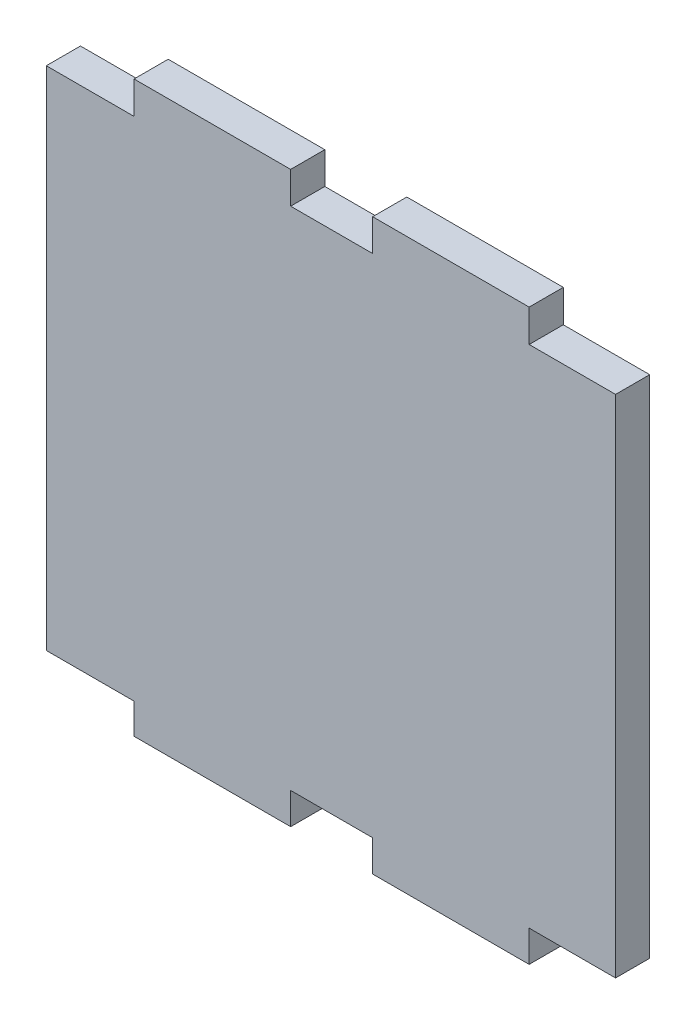
ISO-10303-21;
HEADER;
FILE_DESCRIPTION(('STEP AP214'),'2;1');
FILE_NAME('part.step','',(''),(''),'','','');
FILE_SCHEMA(('AUTOMOTIVE_DESIGN { 1 0 10303 214 1 1 1 1 }'));
ENDSEC;
DATA;
#1=APPLICATION_CONTEXT('core data for automotive mechanical design processes');
#2=APPLICATION_PROTOCOL_DEFINITION('international standard','automotive_design',2000,#1);
#3=PRODUCT_CONTEXT('',#1,'mechanical');
#4=PRODUCT('Part','Part','',(#3));
#5=PRODUCT_RELATED_PRODUCT_CATEGORY('part','',(#4));
#6=PRODUCT_DEFINITION_FORMATION('','',#4);
#7=PRODUCT_DEFINITION_CONTEXT('part definition',#1,'design');
#8=PRODUCT_DEFINITION('design','',#6,#7);
#9=PRODUCT_DEFINITION_SHAPE('','',#8);
#10=(LENGTH_UNIT() NAMED_UNIT(*) SI_UNIT(.MILLI.,.METRE.));
#11=(NAMED_UNIT(*) PLANE_ANGLE_UNIT() SI_UNIT($,.RADIAN.));
#12=(NAMED_UNIT(*) SI_UNIT($,.STERADIAN.) SOLID_ANGLE_UNIT());
#13=UNCERTAINTY_MEASURE_WITH_UNIT(LENGTH_MEASURE(1.E-05),#10,'distance_accuracy_value','');
#14=(GEOMETRIC_REPRESENTATION_CONTEXT(3) GLOBAL_UNCERTAINTY_ASSIGNED_CONTEXT((#13)) GLOBAL_UNIT_ASSIGNED_CONTEXT((#10,
#11,#12)) REPRESENTATION_CONTEXT('',''));
#15=CARTESIAN_POINT('',(0.,0.,0.));
#16=DIRECTION('',(0.,0.,1.));
#17=DIRECTION('',(1.,0.,0.));
#18=AXIS2_PLACEMENT_3D('',#15,#16,#17);
#19=CARTESIAN_POINT('',(0.,0.,12.));
#20=DIRECTION('',(0.,1.,0.));
#21=DIRECTION('',(0.,0.,1.));
#22=AXIS2_PLACEMENT_3D('',#19,#20,#21);
#23=PLANE('',#22);
#24=DIRECTION('',(0.,0.,-1.));
#25=VECTOR('',#24,1.);
#26=CARTESIAN_POINT('',(169.639995288337,0.,12.));
#27=LINE('',#26,#25);
#28=CARTESIAN_POINT('',(169.639995288337,0.,12.));
#29=VERTEX_POINT('',#28);
#30=CARTESIAN_POINT('',(169.639995288337,0.,0.));
#31=VERTEX_POINT('',#30);
#32=EDGE_CURVE('E62',#29,#31,#27,.T.);
#33=ORIENTED_EDGE('',*,*,#32,.F.);
#34=DIRECTION('',(1.,0.,0.));
#35=VECTOR('',#34,1.);
#36=CARTESIAN_POINT('',(0.,0.,12.));
#37=LINE('',#36,#35);
#38=CARTESIAN_POINT('',(114.659446896728,0.,12.));
#39=VERTEX_POINT('',#38);
#40=EDGE_CURVE('E202',#39,#29,#37,.T.);
#41=ORIENTED_EDGE('',*,*,#40,.F.);
#42=DIRECTION('',(0.,0.,-1.));
#43=VECTOR('',#42,1.);
#44=CARTESIAN_POINT('',(114.659446896728,0.,12.));
#45=LINE('',#44,#43);
#46=CARTESIAN_POINT('',(114.659446896728,0.,0.));
#47=VERTEX_POINT('',#46);
#48=EDGE_CURVE('E253',#39,#47,#45,.T.);
#49=ORIENTED_EDGE('',*,*,#48,.T.);
#50=DIRECTION('',(1.,0.,0.));
#51=VECTOR('',#50,1.);
#52=CARTESIAN_POINT('',(0.,0.,0.));
#53=LINE('',#52,#51);
#54=EDGE_CURVE('E216',#47,#31,#53,.T.);
#55=ORIENTED_EDGE('',*,*,#54,.T.);
#56=EDGE_LOOP('',(#33,#41,#49,#55));
#57=FACE_BOUND('',#56,.T.);
#58=ADVANCED_FACE('F37',(#57),#23,.F.);
#59=CARTESIAN_POINT('',(200.,0.,12.));
#60=DIRECTION('',(-1.,0.,0.));
#61=DIRECTION('',(0.,0.,1.));
#62=AXIS2_PLACEMENT_3D('',#59,#60,#61);
#63=PLANE('',#62);
#64=DIRECTION('',(0.,0.,-1.));
#65=VECTOR('',#64,1.);
#66=CARTESIAN_POINT('',(200.,11.04380164,12.));
#67=LINE('',#66,#65);
#68=CARTESIAN_POINT('',(200.,11.04380164,12.));
#69=VERTEX_POINT('',#68);
#70=CARTESIAN_POINT('',(200.,11.04380164,0.));
#71=VERTEX_POINT('',#70);
#72=EDGE_CURVE('E258',#69,#71,#67,.T.);
#73=ORIENTED_EDGE('',*,*,#72,.T.);
#74=DIRECTION('',(0.,1.,0.));
#75=VECTOR('',#74,1.);
#76=CARTESIAN_POINT('',(200.,0.,0.));
#77=LINE('',#76,#75);
#78=CARTESIAN_POINT('',(200.,188.611562278379,0.));
#79=VERTEX_POINT('',#78);
#80=EDGE_CURVE('E205',#71,#79,#77,.T.);
#81=ORIENTED_EDGE('',*,*,#80,.T.);
#82=DIRECTION('',(0.,0.,-1.));
#83=VECTOR('',#82,1.);
#84=CARTESIAN_POINT('',(200.,188.611562278379,12.));
#85=LINE('',#84,#83);
#86=CARTESIAN_POINT('',(200.,188.611562278379,12.));
#87=VERTEX_POINT('',#86);
#88=EDGE_CURVE('E230',#87,#79,#85,.T.);
#89=ORIENTED_EDGE('',*,*,#88,.F.);
#90=DIRECTION('',(0.,1.,0.));
#91=VECTOR('',#90,1.);
#92=CARTESIAN_POINT('',(200.,0.,12.));
#93=LINE('',#92,#91);
#94=EDGE_CURVE('E224',#69,#87,#93,.T.);
#95=ORIENTED_EDGE('',*,*,#94,.F.);
#96=EDGE_LOOP('',(#73,#81,#89,#95));
#97=FACE_BOUND('',#96,.T.);
#98=ADVANCED_FACE('F348',(#97),#63,.F.);
#99=CARTESIAN_POINT('',(0.,200.,12.));
#100=DIRECTION('',(0.,-1.,0.));
#101=DIRECTION('',(0.,0.,-1.));
#102=AXIS2_PLACEMENT_3D('',#99,#100,#101);
#103=PLANE('',#102);
#104=DIRECTION('',(-1.,0.,0.));
#105=VECTOR('',#104,1.);
#106=CARTESIAN_POINT('',(0.,200.,0.));
#107=LINE('',#106,#105);
#108=CARTESIAN_POINT('',(169.639995288337,200.,0.));
#109=VERTEX_POINT('',#108);
#110=CARTESIAN_POINT('',(114.659446896728,200.,0.));
#111=VERTEX_POINT('',#110);
#112=EDGE_CURVE('E191',#109,#111,#107,.T.);
#113=ORIENTED_EDGE('',*,*,#112,.T.);
#114=DIRECTION('',(0.,0.,-1.));
#115=VECTOR('',#114,1.);
#116=CARTESIAN_POINT('',(114.659446896728,200.,12.));
#117=LINE('',#116,#115);
#118=CARTESIAN_POINT('',(114.659446896728,200.,12.));
#119=VERTEX_POINT('',#118);
#120=EDGE_CURVE('E175',#119,#111,#117,.T.);
#121=ORIENTED_EDGE('',*,*,#120,.F.);
#122=DIRECTION('',(-1.,0.,0.));
#123=VECTOR('',#122,1.);
#124=CARTESIAN_POINT('',(0.,200.,12.));
#125=LINE('',#124,#123);
#126=CARTESIAN_POINT('',(169.639995288337,200.,12.));
#127=VERTEX_POINT('',#126);
#128=EDGE_CURVE('E11',#127,#119,#125,.T.);
#129=ORIENTED_EDGE('',*,*,#128,.F.);
#130=DIRECTION('',(0.,0.,-1.));
#131=VECTOR('',#130,1.);
#132=CARTESIAN_POINT('',(169.639995288337,200.,12.));
#133=LINE('',#132,#131);
#134=EDGE_CURVE('E199',#127,#109,#133,.T.);
#135=ORIENTED_EDGE('',*,*,#134,.T.);
#136=EDGE_LOOP('',(#113,#121,#129,#135));
#137=FACE_BOUND('',#136,.T.);
#138=ADVANCED_FACE('F198',(#137),#103,.F.);
#139=CARTESIAN_POINT('',(0.,0.,12.));
#140=DIRECTION('',(0.,0.,-1.));
#141=DIRECTION('',(-1.,0.,0.));
#142=AXIS2_PLACEMENT_3D('',#139,#140,#141);
#143=PLANE('',#142);
#144=DIRECTION('',(-1.,0.,0.));
#145=VECTOR('',#144,1.);
#146=CARTESIAN_POINT('',(200.,11.04380164,12.));
#147=LINE('',#146,#145);
#148=CARTESIAN_POINT('',(169.639995288337,11.04380164,12.));
#149=VERTEX_POINT('',#148);
#150=EDGE_CURVE('E245',#69,#149,#147,.T.);
#151=ORIENTED_EDGE('',*,*,#150,.F.);
#152=ORIENTED_EDGE('',*,*,#94,.T.);
#153=DIRECTION('',(-1.,0.,0.));
#154=VECTOR('',#153,1.);
#155=CARTESIAN_POINT('',(200.,188.611562278379,12.));
#156=LINE('',#155,#154);
#157=CARTESIAN_POINT('',(169.639995288337,188.611562278379,12.));
#158=VERTEX_POINT('',#157);
#159=EDGE_CURVE('E238',#87,#158,#156,.T.);
#160=ORIENTED_EDGE('',*,*,#159,.T.);
#161=DIRECTION('',(0.,1.,0.));
#162=VECTOR('',#161,1.);
#163=CARTESIAN_POINT('',(169.639995288337,188.611562278379,12.));
#164=LINE('',#163,#162);
#165=EDGE_CURVE('E233',#158,#127,#164,.T.);
#166=ORIENTED_EDGE('',*,*,#165,.T.);
#167=ORIENTED_EDGE('',*,*,#128,.T.);
#168=DIRECTION('',(0.,-1.,0.));
#169=VECTOR('',#168,1.);
#170=CARTESIAN_POINT('',(114.659446896728,200.,12.));
#171=LINE('',#170,#169);
#172=CARTESIAN_POINT('',(114.659446896728,188.798084533926,12.));
#173=VERTEX_POINT('',#172);
#174=EDGE_CURVE('E178',#119,#173,#171,.T.);
#175=ORIENTED_EDGE('',*,*,#174,.T.);
#176=DIRECTION('',(-1.,0.,0.));
#177=VECTOR('',#176,1.);
#178=CARTESIAN_POINT('',(114.659446896728,188.798084533926,12.));
#179=LINE('',#178,#177);
#180=CARTESIAN_POINT('',(85.8507587040229,188.798084533926,12.));
#181=VERTEX_POINT('',#180);
#182=EDGE_CURVE('E322',#173,#181,#179,.T.);
#183=ORIENTED_EDGE('',*,*,#182,.T.);
#184=DIRECTION('',(0.,1.,0.));
#185=VECTOR('',#184,1.);
#186=CARTESIAN_POINT('',(85.8507587040229,188.798084533926,12.));
#187=LINE('',#186,#185);
#188=CARTESIAN_POINT('',(85.8507587040229,200.,12.));
#189=VERTEX_POINT('',#188);
#190=EDGE_CURVE('E325',#181,#189,#187,.T.);
#191=ORIENTED_EDGE('',*,*,#190,.T.);
#192=CARTESIAN_POINT('',(30.8313070956314,200.,12.));
#193=VERTEX_POINT('',#192);
#194=EDGE_CURVE('E46',#189,#193,#125,.T.);
#195=ORIENTED_EDGE('',*,*,#194,.T.);
#196=DIRECTION('',(0.,-1.,0.));
#197=VECTOR('',#196,1.);
#198=CARTESIAN_POINT('',(30.8313070956314,200.,12.));
#199=LINE('',#198,#197);
#200=CARTESIAN_POINT('',(30.8313070956314,188.611562277365,12.));
#201=VERTEX_POINT('',#200);
#202=EDGE_CURVE('E308',#193,#201,#199,.T.);
#203=ORIENTED_EDGE('',*,*,#202,.T.);
#204=DIRECTION('',(-1.,0.,0.));
#205=VECTOR('',#204,1.);
#206=CARTESIAN_POINT('',(30.8313070956314,188.611562277365,12.));
#207=LINE('',#206,#205);
#208=CARTESIAN_POINT('',(0.,188.611562277365,12.));
#209=VERTEX_POINT('',#208);
#210=EDGE_CURVE('E304',#201,#209,#207,.T.);
#211=ORIENTED_EDGE('',*,*,#210,.T.);
#212=DIRECTION('',(0.,-1.,0.));
#213=VECTOR('',#212,1.);
#214=CARTESIAN_POINT('',(0.,0.,12.));
#215=LINE('',#214,#213);
#216=CARTESIAN_POINT('',(0.,10.6991655573646,12.));
#217=VERTEX_POINT('',#216);
#218=EDGE_CURVE('E200',#209,#217,#215,.T.);
#219=ORIENTED_EDGE('',*,*,#218,.T.);
#220=DIRECTION('',(1.,0.,0.));
#221=VECTOR('',#220,1.);
#222=CARTESIAN_POINT('',(0.,10.6991655573646,12.));
#223=LINE('',#222,#221);
#224=CARTESIAN_POINT('',(30.8313070956314,10.6991655573646,12.));
#225=VERTEX_POINT('',#224);
#226=EDGE_CURVE('E290',#217,#225,#223,.T.);
#227=ORIENTED_EDGE('',*,*,#226,.T.);
#228=DIRECTION('',(0.,-1.,0.));
#229=VECTOR('',#228,1.);
#230=CARTESIAN_POINT('',(30.8313070956314,10.6991655573646,12.));
#231=LINE('',#230,#229);
#232=CARTESIAN_POINT('',(30.8313070956314,0.,12.));
#233=VERTEX_POINT('',#232);
#234=EDGE_CURVE('E286',#225,#233,#231,.T.);
#235=ORIENTED_EDGE('',*,*,#234,.T.);
#236=CARTESIAN_POINT('',(85.8507587040229,0.,12.));
#237=VERTEX_POINT('',#236);
#238=EDGE_CURVE('E227',#233,#237,#37,.T.);
#239=ORIENTED_EDGE('',*,*,#238,.T.);
#240=DIRECTION('',(0.,1.,0.));
#241=VECTOR('',#240,1.);
#242=CARTESIAN_POINT('',(85.8507587040229,0.,12.));
#243=LINE('',#242,#241);
#244=CARTESIAN_POINT('',(85.8507587040229,11.04380164,12.));
#245=VERTEX_POINT('',#244);
#246=EDGE_CURVE('E260',#237,#245,#243,.T.);
#247=ORIENTED_EDGE('',*,*,#246,.T.);
#248=DIRECTION('',(1.,0.,0.));
#249=VECTOR('',#248,1.);
#250=CARTESIAN_POINT('',(85.8507587040229,11.04380164,12.));
#251=LINE('',#250,#249);
#252=CARTESIAN_POINT('',(114.659446896728,11.04380164,12.));
#253=VERTEX_POINT('',#252);
#254=EDGE_CURVE('E264',#245,#253,#251,.T.);
#255=ORIENTED_EDGE('',*,*,#254,.T.);
#256=DIRECTION('',(0.,1.,0.));
#257=VECTOR('',#256,1.);
#258=CARTESIAN_POINT('',(114.659446896728,0.,12.));
#259=LINE('',#258,#257);
#260=EDGE_CURVE('E267',#39,#253,#259,.T.);
#261=ORIENTED_EDGE('',*,*,#260,.F.);
#262=ORIENTED_EDGE('',*,*,#40,.T.);
#263=DIRECTION('',(0.,-1.,0.));
#264=VECTOR('',#263,1.);
#265=CARTESIAN_POINT('',(169.639995288337,11.04380164,12.));
#266=LINE('',#265,#264);
#267=EDGE_CURVE('E248',#149,#29,#266,.T.);
#268=ORIENTED_EDGE('',*,*,#267,.F.);
#269=EDGE_LOOP('',(#151,#152,#160,#166,#167,#175,#183,#191,#195,#203,#211,#219,#227,#235,#239,
#247,#255,#261,#262,#268));
#270=FACE_BOUND('',#269,.T.);
#271=ADVANCED_FACE('F340',(#270),#143,.F.);
#272=CARTESIAN_POINT('',(0.,0.,0.));
#273=DIRECTION('',(0.,0.,-1.));
#274=DIRECTION('',(-1.,0.,0.));
#275=AXIS2_PLACEMENT_3D('',#272,#273,#274);
#276=PLANE('',#275);
#277=ORIENTED_EDGE('',*,*,#80,.F.);
#278=DIRECTION('',(-1.,0.,0.));
#279=VECTOR('',#278,1.);
#280=CARTESIAN_POINT('',(200.,11.04380164,0.));
#281=LINE('',#280,#279);
#282=CARTESIAN_POINT('',(169.639995288337,11.04380164,0.));
#283=VERTEX_POINT('',#282);
#284=EDGE_CURVE('E250',#71,#283,#281,.T.);
#285=ORIENTED_EDGE('',*,*,#284,.T.);
#286=DIRECTION('',(0.,-1.,0.));
#287=VECTOR('',#286,1.);
#288=CARTESIAN_POINT('',(169.639995288337,11.04380164,0.));
#289=LINE('',#288,#287);
#290=EDGE_CURVE('E247',#283,#31,#289,.T.);
#291=ORIENTED_EDGE('',*,*,#290,.T.);
#292=ORIENTED_EDGE('',*,*,#54,.F.);
#293=DIRECTION('',(0.,1.,0.));
#294=VECTOR('',#293,1.);
#295=CARTESIAN_POINT('',(114.659446896728,0.,0.));
#296=LINE('',#295,#294);
#297=CARTESIAN_POINT('',(114.659446896728,11.04380164,0.));
#298=VERTEX_POINT('',#297);
#299=EDGE_CURVE('E263',#47,#298,#296,.T.);
#300=ORIENTED_EDGE('',*,*,#299,.T.);
#301=DIRECTION('',(1.,0.,0.));
#302=VECTOR('',#301,1.);
#303=CARTESIAN_POINT('',(85.8507587040229,11.04380164,0.));
#304=LINE('',#303,#302);
#305=CARTESIAN_POINT('',(85.8507587040229,11.04380164,0.));
#306=VERTEX_POINT('',#305);
#307=EDGE_CURVE('E274',#306,#298,#304,.T.);
#308=ORIENTED_EDGE('',*,*,#307,.F.);
#309=DIRECTION('',(0.,1.,0.));
#310=VECTOR('',#309,1.);
#311=CARTESIAN_POINT('',(85.8507587040229,0.,0.));
#312=LINE('',#311,#310);
#313=CARTESIAN_POINT('',(85.8507587040229,0.,0.));
#314=VERTEX_POINT('',#313);
#315=EDGE_CURVE('E270',#314,#306,#312,.T.);
#316=ORIENTED_EDGE('',*,*,#315,.F.);
#317=CARTESIAN_POINT('',(30.8313070956314,0.,0.));
#318=VERTEX_POINT('',#317);
#319=EDGE_CURVE('E211',#318,#314,#53,.T.);
#320=ORIENTED_EDGE('',*,*,#319,.F.);
#321=DIRECTION('',(0.,-1.,0.));
#322=VECTOR('',#321,1.);
#323=CARTESIAN_POINT('',(30.8313070956314,10.6991655573646,0.));
#324=LINE('',#323,#322);
#325=CARTESIAN_POINT('',(30.8313070956314,10.6991655573646,0.));
#326=VERTEX_POINT('',#325);
#327=EDGE_CURVE('E294',#326,#318,#324,.T.);
#328=ORIENTED_EDGE('',*,*,#327,.F.);
#329=DIRECTION('',(1.,0.,0.));
#330=VECTOR('',#329,1.);
#331=CARTESIAN_POINT('',(0.,10.6991655573646,0.));
#332=LINE('',#331,#330);
#333=CARTESIAN_POINT('',(0.,10.6991655573646,0.));
#334=VERTEX_POINT('',#333);
#335=EDGE_CURVE('E289',#334,#326,#332,.T.);
#336=ORIENTED_EDGE('',*,*,#335,.F.);
#337=DIRECTION('',(0.,-1.,0.));
#338=VECTOR('',#337,1.);
#339=CARTESIAN_POINT('',(0.,0.,0.));
#340=LINE('',#339,#338);
#341=CARTESIAN_POINT('',(0.,188.611562277365,0.));
#342=VERTEX_POINT('',#341);
#343=EDGE_CURVE('E220',#342,#334,#340,.T.);
#344=ORIENTED_EDGE('',*,*,#343,.F.);
#345=DIRECTION('',(-1.,0.,0.));
#346=VECTOR('',#345,1.);
#347=CARTESIAN_POINT('',(30.8313070956314,188.611562277365,0.));
#348=LINE('',#347,#346);
#349=CARTESIAN_POINT('',(30.8313070956314,188.611562277365,0.));
#350=VERTEX_POINT('',#349);
#351=EDGE_CURVE('E183',#350,#342,#348,.T.);
#352=ORIENTED_EDGE('',*,*,#351,.F.);
#353=DIRECTION('',(0.,-1.,0.));
#354=VECTOR('',#353,1.);
#355=CARTESIAN_POINT('',(30.8313070956314,200.,0.));
#356=LINE('',#355,#354);
#357=CARTESIAN_POINT('',(30.8313070956314,200.,0.));
#358=VERTEX_POINT('',#357);
#359=EDGE_CURVE('E307',#358,#350,#356,.T.);
#360=ORIENTED_EDGE('',*,*,#359,.F.);
#361=CARTESIAN_POINT('',(85.8507587040229,200.,0.));
#362=VERTEX_POINT('',#361);
#363=EDGE_CURVE('E41',#362,#358,#107,.T.);
#364=ORIENTED_EDGE('',*,*,#363,.F.);
#365=DIRECTION('',(0.,1.,0.));
#366=VECTOR('',#365,1.);
#367=CARTESIAN_POINT('',(85.8507587040229,188.798084533926,0.));
#368=LINE('',#367,#366);
#369=CARTESIAN_POINT('',(85.8507587040229,188.798084533926,0.));
#370=VERTEX_POINT('',#369);
#371=EDGE_CURVE('E321',#370,#362,#368,.T.);
#372=ORIENTED_EDGE('',*,*,#371,.F.);
#373=DIRECTION('',(-1.,0.,0.));
#374=VECTOR('',#373,1.);
#375=CARTESIAN_POINT('',(114.659446896728,188.798084533926,0.));
#376=LINE('',#375,#374);
#377=CARTESIAN_POINT('',(114.659446896728,188.798084533926,0.));
#378=VERTEX_POINT('',#377);
#379=EDGE_CURVE('E194',#378,#370,#376,.T.);
#380=ORIENTED_EDGE('',*,*,#379,.F.);
#381=DIRECTION('',(0.,-1.,0.));
#382=VECTOR('',#381,1.);
#383=CARTESIAN_POINT('',(114.659446896728,200.,0.));
#384=LINE('',#383,#382);
#385=EDGE_CURVE('E54',#111,#378,#384,.T.);
#386=ORIENTED_EDGE('',*,*,#385,.F.);
#387=ORIENTED_EDGE('',*,*,#112,.F.);
#388=DIRECTION('',(0.,1.,0.));
#389=VECTOR('',#388,1.);
#390=CARTESIAN_POINT('',(169.639995288337,188.611562278379,0.));
#391=LINE('',#390,#389);
#392=CARTESIAN_POINT('',(169.639995288337,188.611562278379,0.));
#393=VERTEX_POINT('',#392);
#394=EDGE_CURVE('E236',#393,#109,#391,.T.);
#395=ORIENTED_EDGE('',*,*,#394,.F.);
#396=DIRECTION('',(-1.,0.,0.));
#397=VECTOR('',#396,1.);
#398=CARTESIAN_POINT('',(200.,188.611562278379,0.));
#399=LINE('',#398,#397);
#400=EDGE_CURVE('E195',#79,#393,#399,.T.);
#401=ORIENTED_EDGE('',*,*,#400,.F.);
#402=EDGE_LOOP('',(#277,#285,#291,#292,#300,#308,#316,#320,#328,#336,#344,#352,#360,#364,#372,
#380,#386,#387,#395,#401));
#403=FACE_BOUND('',#402,.T.);
#404=ADVANCED_FACE('F189',(#403),#276,.T.);
#405=CARTESIAN_POINT('',(0.,0.,12.));
#406=DIRECTION('',(1.,0.,0.));
#407=DIRECTION('',(0.,0.,-1.));
#408=AXIS2_PLACEMENT_3D('',#405,#406,#407);
#409=PLANE('',#408);
#410=ORIENTED_EDGE('',*,*,#343,.T.);
#411=DIRECTION('',(0.,0.,-1.));
#412=VECTOR('',#411,1.);
#413=CARTESIAN_POINT('',(0.,10.6991655573646,12.));
#414=LINE('',#413,#412);
#415=EDGE_CURVE('E300',#217,#334,#414,.T.);
#416=ORIENTED_EDGE('',*,*,#415,.F.);
#417=ORIENTED_EDGE('',*,*,#218,.F.);
#418=DIRECTION('',(0.,0.,-1.));
#419=VECTOR('',#418,1.);
#420=CARTESIAN_POINT('',(0.,188.611562277365,12.));
#421=LINE('',#420,#419);
#422=EDGE_CURVE('E296',#209,#342,#421,.T.);
#423=ORIENTED_EDGE('',*,*,#422,.T.);
#424=EDGE_LOOP('',(#410,#416,#417,#423));
#425=FACE_BOUND('',#424,.T.);
#426=ADVANCED_FACE('F39',(#425),#409,.F.);
#427=ORIENTED_EDGE('',*,*,#319,.T.);
#428=DIRECTION('',(0.,0.,-1.));
#429=VECTOR('',#428,1.);
#430=CARTESIAN_POINT('',(85.8507587040229,0.,12.));
#431=LINE('',#430,#429);
#432=EDGE_CURVE('E269',#237,#314,#431,.T.);
#433=ORIENTED_EDGE('',*,*,#432,.F.);
#434=ORIENTED_EDGE('',*,*,#238,.F.);
#435=DIRECTION('',(0.,0.,-1.));
#436=VECTOR('',#435,1.);
#437=CARTESIAN_POINT('',(30.8313070956314,0.,12.));
#438=LINE('',#437,#436);
#439=EDGE_CURVE('E293',#233,#318,#438,.T.);
#440=ORIENTED_EDGE('',*,*,#439,.T.);
#441=EDGE_LOOP('',(#427,#433,#434,#440));
#442=FACE_BOUND('',#441,.T.);
#443=ADVANCED_FACE('F372',(#442),#23,.F.);
#444=ORIENTED_EDGE('',*,*,#363,.T.);
#445=DIRECTION('',(0.,0.,-1.));
#446=VECTOR('',#445,1.);
#447=CARTESIAN_POINT('',(30.8313070956314,200.,12.));
#448=LINE('',#447,#446);
#449=EDGE_CURVE('E311',#193,#358,#448,.T.);
#450=ORIENTED_EDGE('',*,*,#449,.F.);
#451=ORIENTED_EDGE('',*,*,#194,.F.);
#452=DIRECTION('',(0.,0.,-1.));
#453=VECTOR('',#452,1.);
#454=CARTESIAN_POINT('',(85.8507587040229,200.,12.));
#455=LINE('',#454,#453);
#456=EDGE_CURVE('E182',#189,#362,#455,.T.);
#457=ORIENTED_EDGE('',*,*,#456,.T.);
#458=EDGE_LOOP('',(#444,#450,#451,#457));
#459=FACE_BOUND('',#458,.T.);
#460=ADVANCED_FACE('F392',(#459),#103,.F.);
#461=CARTESIAN_POINT('',(169.639995288337,188.611562278379,12.));
#462=DIRECTION('',(-1.,0.,0.));
#463=DIRECTION('',(0.,0.,1.));
#464=AXIS2_PLACEMENT_3D('',#461,#462,#463);
#465=PLANE('',#464);
#466=ORIENTED_EDGE('',*,*,#394,.T.);
#467=ORIENTED_EDGE('',*,*,#134,.F.);
#468=ORIENTED_EDGE('',*,*,#165,.F.);
#469=DIRECTION('',(0.,0.,-1.));
#470=VECTOR('',#469,1.);
#471=CARTESIAN_POINT('',(169.639995288337,188.611562278379,12.));
#472=LINE('',#471,#470);
#473=EDGE_CURVE('E232',#158,#393,#472,.T.);
#474=ORIENTED_EDGE('',*,*,#473,.T.);
#475=EDGE_LOOP('',(#466,#467,#468,#474));
#476=FACE_BOUND('',#475,.T.);
#477=ADVANCED_FACE('F343',(#476),#465,.F.);
#478=CARTESIAN_POINT('',(200.,188.611562278379,12.));
#479=DIRECTION('',(0.,-1.,0.));
#480=DIRECTION('',(0.,0.,-1.));
#481=AXIS2_PLACEMENT_3D('',#478,#479,#480);
#482=PLANE('',#481);
#483=ORIENTED_EDGE('',*,*,#400,.T.);
#484=ORIENTED_EDGE('',*,*,#473,.F.);
#485=ORIENTED_EDGE('',*,*,#159,.F.);
#486=ORIENTED_EDGE('',*,*,#88,.T.);
#487=EDGE_LOOP('',(#483,#484,#485,#486));
#488=FACE_BOUND('',#487,.T.);
#489=ADVANCED_FACE('F346',(#488),#482,.F.);
#490=CARTESIAN_POINT('',(114.659446896728,200.,12.));
#491=DIRECTION('',(1.,0.,0.));
#492=DIRECTION('',(0.,0.,-1.));
#493=AXIS2_PLACEMENT_3D('',#490,#491,#492);
#494=PLANE('',#493);
#495=ORIENTED_EDGE('',*,*,#385,.T.);
#496=DIRECTION('',(0.,0.,-1.));
#497=VECTOR('',#496,1.);
#498=CARTESIAN_POINT('',(114.659446896728,188.798084533926,12.));
#499=LINE('',#498,#497);
#500=EDGE_CURVE('E327',#173,#378,#499,.T.);
#501=ORIENTED_EDGE('',*,*,#500,.F.);
#502=ORIENTED_EDGE('',*,*,#174,.F.);
#503=ORIENTED_EDGE('',*,*,#120,.T.);
#504=EDGE_LOOP('',(#495,#501,#502,#503));
#505=FACE_BOUND('',#504,.T.);
#506=ADVANCED_FACE('F176',(#505),#494,.F.);
#507=CARTESIAN_POINT('',(85.8507587040229,188.798084533926,12.));
#508=DIRECTION('',(-1.,0.,0.));
#509=DIRECTION('',(0.,0.,1.));
#510=AXIS2_PLACEMENT_3D('',#507,#508,#509);
#511=PLANE('',#510);
#512=ORIENTED_EDGE('',*,*,#371,.T.);
#513=ORIENTED_EDGE('',*,*,#456,.F.);
#514=ORIENTED_EDGE('',*,*,#190,.F.);
#515=DIRECTION('',(0.,0.,-1.));
#516=VECTOR('',#515,1.);
#517=CARTESIAN_POINT('',(85.8507587040229,188.798084533926,12.));
#518=LINE('',#517,#516);
#519=EDGE_CURVE('E332',#181,#370,#518,.T.);
#520=ORIENTED_EDGE('',*,*,#519,.T.);
#521=EDGE_LOOP('',(#512,#513,#514,#520));
#522=FACE_BOUND('',#521,.T.);
#523=ADVANCED_FACE('F394',(#522),#511,.F.);
#524=CARTESIAN_POINT('',(114.659446896728,188.798084533926,12.));
#525=DIRECTION('',(0.,-1.,0.));
#526=DIRECTION('',(0.,0.,-1.));
#527=AXIS2_PLACEMENT_3D('',#524,#525,#526);
#528=PLANE('',#527);
#529=ORIENTED_EDGE('',*,*,#379,.T.);
#530=ORIENTED_EDGE('',*,*,#519,.F.);
#531=ORIENTED_EDGE('',*,*,#182,.F.);
#532=ORIENTED_EDGE('',*,*,#500,.T.);
#533=EDGE_LOOP('',(#529,#530,#531,#532));
#534=FACE_BOUND('',#533,.T.);
#535=ADVANCED_FACE('F336',(#534),#528,.F.);
#536=CARTESIAN_POINT('',(30.8313070956314,188.611562277365,12.));
#537=DIRECTION('',(0.,-1.,0.));
#538=DIRECTION('',(0.,0.,-1.));
#539=AXIS2_PLACEMENT_3D('',#536,#537,#538);
#540=PLANE('',#539);
#541=ORIENTED_EDGE('',*,*,#351,.T.);
#542=ORIENTED_EDGE('',*,*,#422,.F.);
#543=ORIENTED_EDGE('',*,*,#210,.F.);
#544=DIRECTION('',(0.,0.,-1.));
#545=VECTOR('',#544,1.);
#546=CARTESIAN_POINT('',(30.8313070956314,188.611562277365,12.));
#547=LINE('',#546,#545);
#548=EDGE_CURVE('E316',#201,#350,#547,.T.);
#549=ORIENTED_EDGE('',*,*,#548,.T.);
#550=EDGE_LOOP('',(#541,#542,#543,#549));
#551=FACE_BOUND('',#550,.T.);
#552=ADVANCED_FACE('F387',(#551),#540,.F.);
#553=CARTESIAN_POINT('',(30.8313070956314,200.,12.));
#554=DIRECTION('',(1.,0.,0.));
#555=DIRECTION('',(0.,0.,-1.));
#556=AXIS2_PLACEMENT_3D('',#553,#554,#555);
#557=PLANE('',#556);
#558=ORIENTED_EDGE('',*,*,#359,.T.);
#559=ORIENTED_EDGE('',*,*,#548,.F.);
#560=ORIENTED_EDGE('',*,*,#202,.F.);
#561=ORIENTED_EDGE('',*,*,#449,.T.);
#562=EDGE_LOOP('',(#558,#559,#560,#561));
#563=FACE_BOUND('',#562,.T.);
#564=ADVANCED_FACE('F390',(#563),#557,.F.);
#565=CARTESIAN_POINT('',(30.8313070956314,10.6991655573646,12.));
#566=DIRECTION('',(1.,0.,0.));
#567=DIRECTION('',(0.,1.,0.));
#568=AXIS2_PLACEMENT_3D('',#565,#566,#567);
#569=PLANE('',#568);
#570=ORIENTED_EDGE('',*,*,#327,.T.);
#571=ORIENTED_EDGE('',*,*,#439,.F.);
#572=ORIENTED_EDGE('',*,*,#234,.F.);
#573=DIRECTION('',(0.,0.,-1.));
#574=VECTOR('',#573,1.);
#575=CARTESIAN_POINT('',(30.8313070956314,10.6991655573646,12.));
#576=LINE('',#575,#574);
#577=EDGE_CURVE('E273',#225,#326,#576,.T.);
#578=ORIENTED_EDGE('',*,*,#577,.T.);
#579=EDGE_LOOP('',(#570,#571,#572,#578));
#580=FACE_BOUND('',#579,.T.);
#581=ADVANCED_FACE('F376',(#580),#569,.F.);
#582=CARTESIAN_POINT('',(0.,10.6991655573646,12.));
#583=DIRECTION('',(0.,1.,0.));
#584=DIRECTION('',(-1.,0.,0.));
#585=AXIS2_PLACEMENT_3D('',#582,#583,#584);
#586=PLANE('',#585);
#587=ORIENTED_EDGE('',*,*,#335,.T.);
#588=ORIENTED_EDGE('',*,*,#577,.F.);
#589=ORIENTED_EDGE('',*,*,#226,.F.);
#590=ORIENTED_EDGE('',*,*,#415,.T.);
#591=EDGE_LOOP('',(#587,#588,#589,#590));
#592=FACE_BOUND('',#591,.T.);
#593=ADVANCED_FACE('F380',(#592),#586,.F.);
#594=CARTESIAN_POINT('',(114.659446896728,0.,12.));
#595=DIRECTION('',(-1.,0.,0.));
#596=DIRECTION('',(0.,0.,1.));
#597=AXIS2_PLACEMENT_3D('',#594,#595,#596);
#598=PLANE('',#597);
#599=ORIENTED_EDGE('',*,*,#299,.F.);
#600=ORIENTED_EDGE('',*,*,#48,.F.);
#601=ORIENTED_EDGE('',*,*,#260,.T.);
#602=DIRECTION('',(0.,0.,-1.));
#603=VECTOR('',#602,1.);
#604=CARTESIAN_POINT('',(114.659446896728,11.04380164,12.));
#605=LINE('',#604,#603);
#606=EDGE_CURVE('E281',#253,#298,#605,.T.);
#607=ORIENTED_EDGE('',*,*,#606,.T.);
#608=EDGE_LOOP('',(#599,#600,#601,#607));
#609=FACE_BOUND('',#608,.T.);
#610=ADVANCED_FACE('F359',(#609),#598,.T.);
#611=CARTESIAN_POINT('',(85.8507587040229,11.04380164,12.));
#612=DIRECTION('',(0.,1.,0.));
#613=DIRECTION('',(-1.,0.,0.));
#614=AXIS2_PLACEMENT_3D('',#611,#612,#613);
#615=PLANE('',#614);
#616=ORIENTED_EDGE('',*,*,#307,.T.);
#617=ORIENTED_EDGE('',*,*,#606,.F.);
#618=ORIENTED_EDGE('',*,*,#254,.F.);
#619=DIRECTION('',(0.,0.,-1.));
#620=VECTOR('',#619,1.);
#621=CARTESIAN_POINT('',(85.8507587040229,11.04380164,12.));
#622=LINE('',#621,#620);
#623=EDGE_CURVE('E283',#245,#306,#622,.T.);
#624=ORIENTED_EDGE('',*,*,#623,.T.);
#625=EDGE_LOOP('',(#616,#617,#618,#624));
#626=FACE_BOUND('',#625,.T.);
#627=ADVANCED_FACE('F364',(#626),#615,.F.);
#628=CARTESIAN_POINT('',(85.8507587040229,0.,12.));
#629=DIRECTION('',(-1.,0.,0.));
#630=DIRECTION('',(0.,0.,1.));
#631=AXIS2_PLACEMENT_3D('',#628,#629,#630);
#632=PLANE('',#631);
#633=ORIENTED_EDGE('',*,*,#315,.T.);
#634=ORIENTED_EDGE('',*,*,#623,.F.);
#635=ORIENTED_EDGE('',*,*,#246,.F.);
#636=ORIENTED_EDGE('',*,*,#432,.T.);
#637=EDGE_LOOP('',(#633,#634,#635,#636));
#638=FACE_BOUND('',#637,.T.);
#639=ADVANCED_FACE('F432',(#638),#632,.F.);
#640=CARTESIAN_POINT('',(200.,11.04380164,12.));
#641=DIRECTION('',(0.,-1.,0.));
#642=DIRECTION('',(0.,0.,-1.));
#643=AXIS2_PLACEMENT_3D('',#640,#641,#642);
#644=PLANE('',#643);
#645=ORIENTED_EDGE('',*,*,#284,.F.);
#646=ORIENTED_EDGE('',*,*,#72,.F.);
#647=ORIENTED_EDGE('',*,*,#150,.T.);
#648=DIRECTION('',(0.,0.,-1.));
#649=VECTOR('',#648,1.);
#650=CARTESIAN_POINT('',(169.639995288337,11.04380164,12.));
#651=LINE('',#650,#649);
#652=EDGE_CURVE('E256',#149,#283,#651,.T.);
#653=ORIENTED_EDGE('',*,*,#652,.T.);
#654=EDGE_LOOP('',(#645,#646,#647,#653));
#655=FACE_BOUND('',#654,.T.);
#656=ADVANCED_FACE('F352',(#655),#644,.T.);
#657=CARTESIAN_POINT('',(169.639995288337,11.04380164,12.));
#658=DIRECTION('',(1.,0.,0.));
#659=DIRECTION('',(0.,0.,-1.));
#660=AXIS2_PLACEMENT_3D('',#657,#658,#659);
#661=PLANE('',#660);
#662=ORIENTED_EDGE('',*,*,#290,.F.);
#663=ORIENTED_EDGE('',*,*,#652,.F.);
#664=ORIENTED_EDGE('',*,*,#267,.T.);
#665=ORIENTED_EDGE('',*,*,#32,.T.);
#666=EDGE_LOOP('',(#662,#663,#664,#665));
#667=FACE_BOUND('',#666,.T.);
#668=ADVANCED_FACE('F353',(#667),#661,.T.);
#669=CLOSED_SHELL('',(#58,#98,#138,#271,#404,#426,#443,#460,#477,#489,#506,#523,#535,#552,#564,
#581,#593,#610,#627,#639,#656,#668));
#670=MANIFOLD_SOLID_BREP('B2',#669);
#671=ADVANCED_BREP_SHAPE_REPRESENTATION('',(#18,#670),#14);
#672=SHAPE_DEFINITION_REPRESENTATION(#9,#671);
ENDSEC;
END-ISO-10303-21;
